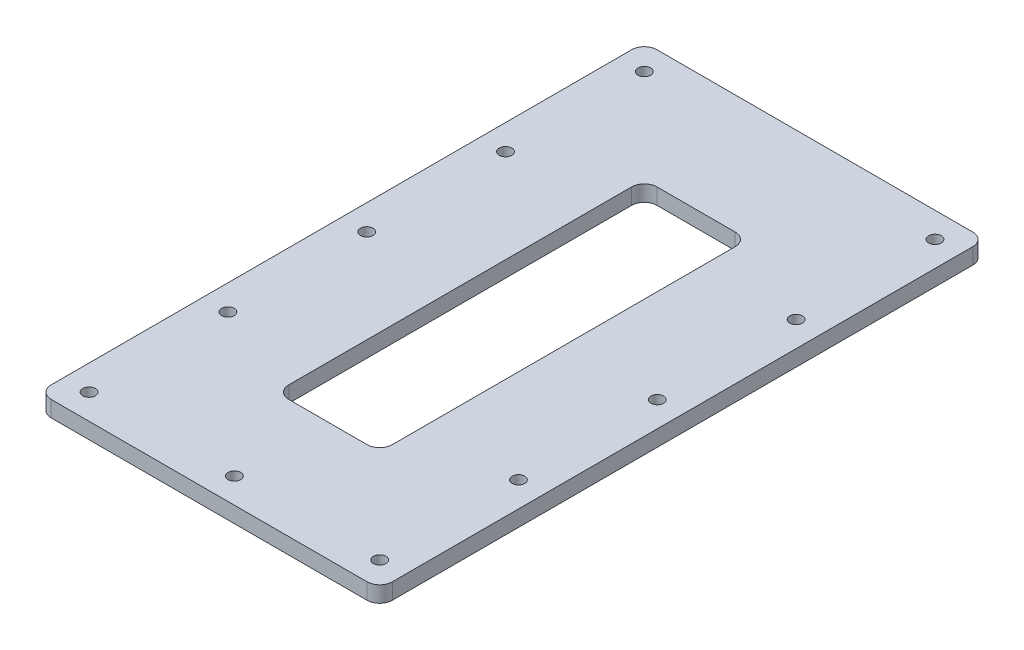
ISO-10303-21;
HEADER;
FILE_DESCRIPTION(('STEP AP214'),'2;1');
FILE_NAME('part.step','',(''),(''),'','','');
FILE_SCHEMA(('AUTOMOTIVE_DESIGN { 1 0 10303 214 1 1 1 1 }'));
ENDSEC;
DATA;
#1=APPLICATION_CONTEXT('core data for automotive mechanical design processes');
#2=APPLICATION_PROTOCOL_DEFINITION('international standard','automotive_design',2000,#1);
#3=PRODUCT_CONTEXT('',#1,'mechanical');
#4=PRODUCT('Part','Part','',(#3));
#5=PRODUCT_RELATED_PRODUCT_CATEGORY('part','',(#4));
#6=PRODUCT_DEFINITION_FORMATION('','',#4);
#7=PRODUCT_DEFINITION_CONTEXT('part definition',#1,'design');
#8=PRODUCT_DEFINITION('design','',#6,#7);
#9=PRODUCT_DEFINITION_SHAPE('','',#8);
#10=(LENGTH_UNIT() NAMED_UNIT(*) SI_UNIT(.MILLI.,.METRE.));
#11=(NAMED_UNIT(*) PLANE_ANGLE_UNIT() SI_UNIT($,.RADIAN.));
#12=(NAMED_UNIT(*) SI_UNIT($,.STERADIAN.) SOLID_ANGLE_UNIT());
#13=UNCERTAINTY_MEASURE_WITH_UNIT(LENGTH_MEASURE(1.E-05),#10,'distance_accuracy_value','');
#14=(GEOMETRIC_REPRESENTATION_CONTEXT(3) GLOBAL_UNCERTAINTY_ASSIGNED_CONTEXT((#13)) GLOBAL_UNIT_ASSIGNED_CONTEXT((#10,
#11,#12)) REPRESENTATION_CONTEXT('',''));
#15=CARTESIAN_POINT('',(0.,0.,0.));
#16=DIRECTION('',(0.,0.,1.));
#17=DIRECTION('',(1.,0.,0.));
#18=AXIS2_PLACEMENT_3D('',#15,#16,#17);
#19=CARTESIAN_POINT('',(-67.575,-6.35,-120.));
#20=DIRECTION('',(1.,0.,0.));
#21=DIRECTION('',(0.,0.,1.));
#22=AXIS2_PLACEMENT_3D('',#19,#20,#21);
#23=PLANE('',#22);
#24=DIRECTION('',(0.,0.,1.));
#25=VECTOR('',#24,1.);
#26=CARTESIAN_POINT('',(-67.575,-6.35,-120.));
#27=LINE('',#26,#25);
#28=CARTESIAN_POINT('',(-67.575,-6.35,-115.));
#29=VERTEX_POINT('',#28);
#30=CARTESIAN_POINT('',(-67.575,-6.35,115.));
#31=VERTEX_POINT('',#30);
#32=EDGE_CURVE('E255',#29,#31,#27,.T.);
#33=ORIENTED_EDGE('',*,*,#32,.T.);
#34=DIRECTION('',(0.,1.,0.));
#35=VECTOR('',#34,1.);
#36=CARTESIAN_POINT('',(-67.575,-6.35,115.));
#37=LINE('',#36,#35);
#38=CARTESIAN_POINT('',(-67.575,0.,115.));
#39=VERTEX_POINT('',#38);
#40=EDGE_CURVE('E313',#39,#31,#37,.F.);
#41=ORIENTED_EDGE('',*,*,#40,.F.);
#42=DIRECTION('',(0.,0.,1.));
#43=VECTOR('',#42,1.);
#44=CARTESIAN_POINT('',(-67.575,0.,-120.));
#45=LINE('',#44,#43);
#46=CARTESIAN_POINT('',(-67.575,0.,-115.));
#47=VERTEX_POINT('',#46);
#48=EDGE_CURVE('E263',#47,#39,#45,.T.);
#49=ORIENTED_EDGE('',*,*,#48,.F.);
#50=DIRECTION('',(0.,1.,0.));
#51=VECTOR('',#50,1.);
#52=CARTESIAN_POINT('',(-67.575,-6.35,-115.));
#53=LINE('',#52,#51);
#54=EDGE_CURVE('E316',#29,#47,#53,.T.);
#55=ORIENTED_EDGE('',*,*,#54,.F.);
#56=EDGE_LOOP('',(#33,#41,#49,#55));
#57=FACE_BOUND('',#56,.T.);
#58=ADVANCED_FACE('F34',(#57),#23,.F.);
#59=CARTESIAN_POINT('',(67.575,-6.35,-120.));
#60=DIRECTION('',(-1.,0.,0.));
#61=DIRECTION('',(0.,0.,-1.));
#62=AXIS2_PLACEMENT_3D('',#59,#60,#61);
#63=PLANE('',#62);
#64=DIRECTION('',(0.,0.,-1.));
#65=VECTOR('',#64,1.);
#66=CARTESIAN_POINT('',(67.575,0.,-120.));
#67=LINE('',#66,#65);
#68=CARTESIAN_POINT('',(67.575,0.,115.));
#69=VERTEX_POINT('',#68);
#70=CARTESIAN_POINT('',(67.575,0.,-115.));
#71=VERTEX_POINT('',#70);
#72=EDGE_CURVE('E248',#69,#71,#67,.T.);
#73=ORIENTED_EDGE('',*,*,#72,.F.);
#74=DIRECTION('',(0.,1.,0.));
#75=VECTOR('',#74,1.);
#76=CARTESIAN_POINT('',(67.575,-6.35,115.));
#77=LINE('',#76,#75);
#78=CARTESIAN_POINT('',(67.575,-6.35,115.));
#79=VERTEX_POINT('',#78);
#80=EDGE_CURVE('E297',#79,#69,#77,.T.);
#81=ORIENTED_EDGE('',*,*,#80,.F.);
#82=DIRECTION('',(0.,0.,-1.));
#83=VECTOR('',#82,1.);
#84=CARTESIAN_POINT('',(67.575,-6.35,-120.));
#85=LINE('',#84,#83);
#86=CARTESIAN_POINT('',(67.575,-6.35,-115.));
#87=VERTEX_POINT('',#86);
#88=EDGE_CURVE('E249',#79,#87,#85,.T.);
#89=ORIENTED_EDGE('',*,*,#88,.T.);
#90=DIRECTION('',(0.,1.,0.));
#91=VECTOR('',#90,1.);
#92=CARTESIAN_POINT('',(67.575,-6.35,-115.));
#93=LINE('',#92,#91);
#94=EDGE_CURVE('E300',#71,#87,#93,.F.);
#95=ORIENTED_EDGE('',*,*,#94,.F.);
#96=EDGE_LOOP('',(#73,#81,#89,#95));
#97=FACE_BOUND('',#96,.T.);
#98=ADVANCED_FACE('F346',(#97),#63,.F.);
#99=CARTESIAN_POINT('',(-62.575,-6.35,-115.));
#100=DIRECTION('',(0.,1.,0.));
#101=DIRECTION('',(0.,0.,1.));
#102=AXIS2_PLACEMENT_3D('',#99,#100,#101);
#103=CYLINDRICAL_SURFACE('',#102,5.);
#104=CARTESIAN_POINT('',(-62.575,-6.35,-115.));
#105=DIRECTION('',(0.,1.,0.));
#106=DIRECTION('',(0.,0.,-1.));
#107=AXIS2_PLACEMENT_3D('',#104,#105,#106);
#108=CIRCLE('',#107,5.);
#109=CARTESIAN_POINT('',(-62.575,-6.35,-120.));
#110=VERTEX_POINT('',#109);
#111=EDGE_CURVE('E308',#110,#29,#108,.T.);
#112=ORIENTED_EDGE('',*,*,#111,.T.);
#113=ORIENTED_EDGE('',*,*,#54,.T.);
#114=CARTESIAN_POINT('',(-62.575,0.,-115.));
#115=DIRECTION('',(0.,1.,0.));
#116=DIRECTION('',(0.,0.,-1.));
#117=AXIS2_PLACEMENT_3D('',#114,#115,#116);
#118=CIRCLE('',#117,5.);
#119=CARTESIAN_POINT('',(-62.575,0.,-120.));
#120=VERTEX_POINT('',#119);
#121=EDGE_CURVE('E292',#47,#120,#118,.F.);
#122=ORIENTED_EDGE('',*,*,#121,.T.);
#123=DIRECTION('',(0.,1.,0.));
#124=VECTOR('',#123,1.);
#125=CARTESIAN_POINT('',(-62.575,-6.35,-120.));
#126=LINE('',#125,#124);
#127=EDGE_CURVE('E282',#120,#110,#126,.F.);
#128=ORIENTED_EDGE('',*,*,#127,.T.);
#129=EDGE_LOOP('',(#112,#113,#122,#128));
#130=FACE_BOUND('',#129,.T.);
#131=ADVANCED_FACE('F335',(#130),#103,.T.);
#132=CARTESIAN_POINT('',(62.575,-6.35,-115.));
#133=DIRECTION('',(0.,1.,0.));
#134=DIRECTION('',(0.,0.,1.));
#135=AXIS2_PLACEMENT_3D('',#132,#133,#134);
#136=CYLINDRICAL_SURFACE('',#135,5.);
#137=CARTESIAN_POINT('',(62.575,-6.35,-115.));
#138=DIRECTION('',(0.,1.,0.));
#139=DIRECTION('',(0.,0.,-1.));
#140=AXIS2_PLACEMENT_3D('',#137,#138,#139);
#141=CIRCLE('',#140,5.);
#142=CARTESIAN_POINT('',(62.575,-6.35,-120.));
#143=VERTEX_POINT('',#142);
#144=EDGE_CURVE('E310',#87,#143,#141,.T.);
#145=ORIENTED_EDGE('',*,*,#144,.T.);
#146=DIRECTION('',(0.,1.,0.));
#147=VECTOR('',#146,1.);
#148=CARTESIAN_POINT('',(62.575,-6.35,-120.));
#149=LINE('',#148,#147);
#150=CARTESIAN_POINT('',(62.575,0.,-120.));
#151=VERTEX_POINT('',#150);
#152=EDGE_CURVE('E285',#143,#151,#149,.T.);
#153=ORIENTED_EDGE('',*,*,#152,.T.);
#154=CARTESIAN_POINT('',(62.575,0.,-115.));
#155=DIRECTION('',(0.,1.,0.));
#156=DIRECTION('',(0.,0.,-1.));
#157=AXIS2_PLACEMENT_3D('',#154,#155,#156);
#158=CIRCLE('',#157,5.);
#159=EDGE_CURVE('E295',#151,#71,#158,.F.);
#160=ORIENTED_EDGE('',*,*,#159,.T.);
#161=ORIENTED_EDGE('',*,*,#94,.T.);
#162=EDGE_LOOP('',(#145,#153,#160,#161));
#163=FACE_BOUND('',#162,.T.);
#164=ADVANCED_FACE('F341',(#163),#136,.T.);
#165=CARTESIAN_POINT('',(-62.575,-6.35,115.));
#166=DIRECTION('',(0.,1.,0.));
#167=DIRECTION('',(0.,0.,1.));
#168=AXIS2_PLACEMENT_3D('',#165,#166,#167);
#169=CYLINDRICAL_SURFACE('',#168,5.);
#170=CARTESIAN_POINT('',(-62.575,-6.35,115.));
#171=DIRECTION('',(0.,1.,0.));
#172=DIRECTION('',(0.,0.,-1.));
#173=AXIS2_PLACEMENT_3D('',#170,#171,#172);
#174=CIRCLE('',#173,5.);
#175=CARTESIAN_POINT('',(-62.575,-6.35,120.));
#176=VERTEX_POINT('',#175);
#177=EDGE_CURVE('E303',#31,#176,#174,.T.);
#178=ORIENTED_EDGE('',*,*,#177,.T.);
#179=DIRECTION('',(0.,1.,0.));
#180=VECTOR('',#179,1.);
#181=CARTESIAN_POINT('',(-62.575,-6.35,120.));
#182=LINE('',#181,#180);
#183=CARTESIAN_POINT('',(-62.575,0.,120.));
#184=VERTEX_POINT('',#183);
#185=EDGE_CURVE('E179',#176,#184,#182,.T.);
#186=ORIENTED_EDGE('',*,*,#185,.T.);
#187=CARTESIAN_POINT('',(-62.575,0.,115.));
#188=DIRECTION('',(0.,1.,0.));
#189=DIRECTION('',(0.,0.,-1.));
#190=AXIS2_PLACEMENT_3D('',#187,#188,#189);
#191=CIRCLE('',#190,5.);
#192=EDGE_CURVE('E288',#184,#39,#191,.F.);
#193=ORIENTED_EDGE('',*,*,#192,.T.);
#194=ORIENTED_EDGE('',*,*,#40,.T.);
#195=EDGE_LOOP('',(#178,#186,#193,#194));
#196=FACE_BOUND('',#195,.T.);
#197=ADVANCED_FACE('F36',(#196),#169,.T.);
#198=CARTESIAN_POINT('',(-20.5132278041638,3.65,-72.9382278041638));
#199=DIRECTION('',(-1.,0.,0.));
#200=DIRECTION('',(0.,1.,0.));
#201=AXIS2_PLACEMENT_3D('',#198,#199,#200);
#202=PLANE('',#201);
#203=DIRECTION('',(0.,0.,1.));
#204=VECTOR('',#203,1.);
#205=CARTESIAN_POINT('',(-20.5132278041638,-6.35,-72.9382278041638));
#206=LINE('',#205,#204);
#207=CARTESIAN_POINT('',(-20.5132278041638,-6.35,-67.9382278041638));
#208=VERTEX_POINT('',#207);
#209=CARTESIAN_POINT('',(-20.5132278041638,-6.35,67.9382278041638));
#210=VERTEX_POINT('',#209);
#211=EDGE_CURVE('E170',#208,#210,#206,.T.);
#212=ORIENTED_EDGE('',*,*,#211,.F.);
#213=DIRECTION('',(0.,-1.,0.));
#214=VECTOR('',#213,1.);
#215=CARTESIAN_POINT('',(-20.5132278041638,-6.35,-67.9382278041638));
#216=LINE('',#215,#214);
#217=CARTESIAN_POINT('',(-20.5132278041638,0.,-67.9382278041638));
#218=VERTEX_POINT('',#217);
#219=EDGE_CURVE('E159',#218,#208,#216,.T.);
#220=ORIENTED_EDGE('',*,*,#219,.F.);
#221=DIRECTION('',(0.,0.,1.));
#222=VECTOR('',#221,1.);
#223=CARTESIAN_POINT('',(-20.5132278041638,0.,0.));
#224=LINE('',#223,#222);
#225=CARTESIAN_POINT('',(-20.5132278041638,0.,67.9382278041638));
#226=VERTEX_POINT('',#225);
#227=EDGE_CURVE('E240',#218,#226,#224,.T.);
#228=ORIENTED_EDGE('',*,*,#227,.T.);
#229=DIRECTION('',(0.,-1.,0.));
#230=VECTOR('',#229,1.);
#231=CARTESIAN_POINT('',(-20.5132278041638,0.,67.9382278041638));
#232=LINE('',#231,#230);
#233=EDGE_CURVE('E270',#210,#226,#232,.F.);
#234=ORIENTED_EDGE('',*,*,#233,.F.);
#235=EDGE_LOOP('',(#212,#220,#228,#234));
#236=FACE_BOUND('',#235,.T.);
#237=ADVANCED_FACE('F398',(#236),#202,.F.);
#238=CARTESIAN_POINT('',(0.,-6.35,0.));
#239=DIRECTION('',(0.,-1.,0.));
#240=DIRECTION('',(0.,0.,-1.));
#241=AXIS2_PLACEMENT_3D('',#238,#239,#240);
#242=PLANE('',#241);
#243=CARTESIAN_POINT('',(-57.5749999999999,-6.35,-110.));
#244=DIRECTION('',(0.,1.,0.));
#245=DIRECTION('',(0.,0.,-1.));
#246=AXIS2_PLACEMENT_3D('',#243,#244,#245);
#247=CIRCLE('',#246,2.5);
#248=CARTESIAN_POINT('',(-57.5749999999999,-6.35,-112.5));
#249=VERTEX_POINT('',#248);
#250=EDGE_CURVE('E38',#249,#249,#247,.T.);
#251=ORIENTED_EDGE('',*,*,#250,.T.);
#252=EDGE_LOOP('',(#251));
#253=FACE_BOUND('',#252,.T.);
#254=CARTESIAN_POINT('',(57.5750000000001,-6.35,-110.));
#255=DIRECTION('',(0.,1.,0.));
#256=DIRECTION('',(0.,0.,-1.));
#257=AXIS2_PLACEMENT_3D('',#254,#255,#256);
#258=CIRCLE('',#257,2.50000000000001);
#259=CARTESIAN_POINT('',(57.5750000000001,-6.35,-112.5));
#260=VERTEX_POINT('',#259);
#261=EDGE_CURVE('E220',#260,#260,#258,.T.);
#262=ORIENTED_EDGE('',*,*,#261,.T.);
#263=EDGE_LOOP('',(#262));
#264=FACE_BOUND('',#263,.T.);
#265=CARTESIAN_POINT('',(57.5750000000001,-6.35,-55.));
#266=DIRECTION('',(0.,1.,0.));
#267=DIRECTION('',(0.,0.,-1.));
#268=AXIS2_PLACEMENT_3D('',#265,#266,#267);
#269=CIRCLE('',#268,2.5);
#270=CARTESIAN_POINT('',(57.5750000000001,-6.35,-57.5));
#271=VERTEX_POINT('',#270);
#272=EDGE_CURVE('E218',#271,#271,#269,.T.);
#273=ORIENTED_EDGE('',*,*,#272,.T.);
#274=EDGE_LOOP('',(#273));
#275=FACE_BOUND('',#274,.T.);
#276=CARTESIAN_POINT('',(-57.5749999999999,-6.35,-55.));
#277=DIRECTION('',(0.,1.,0.));
#278=DIRECTION('',(0.,0.,-1.));
#279=AXIS2_PLACEMENT_3D('',#276,#277,#278);
#280=CIRCLE('',#279,2.5);
#281=CARTESIAN_POINT('',(-57.5749999999999,-6.35,-57.5));
#282=VERTEX_POINT('',#281);
#283=EDGE_CURVE('E215',#282,#282,#280,.T.);
#284=ORIENTED_EDGE('',*,*,#283,.T.);
#285=EDGE_LOOP('',(#284));
#286=FACE_BOUND('',#285,.T.);
#287=CARTESIAN_POINT('',(-57.5749999999999,-6.35,0.));
#288=DIRECTION('',(0.,1.,0.));
#289=DIRECTION('',(0.,0.,-1.));
#290=AXIS2_PLACEMENT_3D('',#287,#288,#289);
#291=CIRCLE('',#290,2.5);
#292=CARTESIAN_POINT('',(-57.5749999999999,-6.35,-2.49999999999996));
#293=VERTEX_POINT('',#292);
#294=EDGE_CURVE('E212',#293,#293,#291,.T.);
#295=ORIENTED_EDGE('',*,*,#294,.T.);
#296=EDGE_LOOP('',(#295));
#297=FACE_BOUND('',#296,.T.);
#298=CARTESIAN_POINT('',(57.5750000000001,-6.35,0.));
#299=DIRECTION('',(0.,1.,0.));
#300=DIRECTION('',(0.,0.,-1.));
#301=AXIS2_PLACEMENT_3D('',#298,#299,#300);
#302=CIRCLE('',#301,2.5);
#303=CARTESIAN_POINT('',(57.5750000000001,-6.35,-2.49999999999996));
#304=VERTEX_POINT('',#303);
#305=EDGE_CURVE('E209',#304,#304,#302,.T.);
#306=ORIENTED_EDGE('',*,*,#305,.T.);
#307=EDGE_LOOP('',(#306));
#308=FACE_BOUND('',#307,.T.);
#309=CARTESIAN_POINT('',(57.5750000000001,-6.35,55.));
#310=DIRECTION('',(0.,1.,0.));
#311=DIRECTION('',(0.,0.,-1.));
#312=AXIS2_PLACEMENT_3D('',#309,#310,#311);
#313=CIRCLE('',#312,2.5);
#314=CARTESIAN_POINT('',(57.5750000000001,-6.35,52.5));
#315=VERTEX_POINT('',#314);
#316=EDGE_CURVE('E206',#315,#315,#313,.T.);
#317=ORIENTED_EDGE('',*,*,#316,.T.);
#318=EDGE_LOOP('',(#317));
#319=FACE_BOUND('',#318,.T.);
#320=CARTESIAN_POINT('',(-57.5749999999999,-6.35,55.));
#321=DIRECTION('',(0.,1.,0.));
#322=DIRECTION('',(0.,0.,-1.));
#323=AXIS2_PLACEMENT_3D('',#320,#321,#322);
#324=CIRCLE('',#323,2.5);
#325=CARTESIAN_POINT('',(-57.5749999999999,-6.35,52.5));
#326=VERTEX_POINT('',#325);
#327=EDGE_CURVE('E203',#326,#326,#324,.T.);
#328=ORIENTED_EDGE('',*,*,#327,.T.);
#329=EDGE_LOOP('',(#328));
#330=FACE_BOUND('',#329,.T.);
#331=CARTESIAN_POINT('',(-57.5749999999999,-6.35,110.));
#332=DIRECTION('',(0.,1.,0.));
#333=DIRECTION('',(0.,0.,-1.));
#334=AXIS2_PLACEMENT_3D('',#331,#332,#333);
#335=CIRCLE('',#334,2.50000000000001);
#336=CARTESIAN_POINT('',(-57.5749999999999,-6.35,107.5));
#337=VERTEX_POINT('',#336);
#338=EDGE_CURVE('E200',#337,#337,#335,.T.);
#339=ORIENTED_EDGE('',*,*,#338,.T.);
#340=EDGE_LOOP('',(#339));
#341=FACE_BOUND('',#340,.T.);
#342=CARTESIAN_POINT('',(1.11022302462516E-13,-6.35,110.));
#343=DIRECTION('',(0.,1.,0.));
#344=DIRECTION('',(0.,0.,-1.));
#345=AXIS2_PLACEMENT_3D('',#342,#343,#344);
#346=CIRCLE('',#345,2.5);
#347=CARTESIAN_POINT('',(1.11022302462516E-13,-6.35,107.5));
#348=VERTEX_POINT('',#347);
#349=EDGE_CURVE('E196',#348,#348,#346,.T.);
#350=ORIENTED_EDGE('',*,*,#349,.T.);
#351=EDGE_LOOP('',(#350));
#352=FACE_BOUND('',#351,.T.);
#353=CARTESIAN_POINT('',(57.5750000000001,-6.35,110.));
#354=DIRECTION('',(0.,1.,0.));
#355=DIRECTION('',(0.,0.,-1.));
#356=AXIS2_PLACEMENT_3D('',#353,#354,#355);
#357=CIRCLE('',#356,2.5);
#358=CARTESIAN_POINT('',(57.5750000000001,-6.35,107.5));
#359=VERTEX_POINT('',#358);
#360=EDGE_CURVE('E193',#359,#359,#357,.T.);
#361=ORIENTED_EDGE('',*,*,#360,.T.);
#362=EDGE_LOOP('',(#361));
#363=FACE_BOUND('',#362,.T.);
#364=DIRECTION('',(0.,0.,-1.));
#365=VECTOR('',#364,1.);
#366=CARTESIAN_POINT('',(20.5132278041638,-6.35,-72.9382278041638));
#367=LINE('',#366,#365);
#368=CARTESIAN_POINT('',(20.5132278041638,-6.35,67.9382278041638));
#369=VERTEX_POINT('',#368);
#370=CARTESIAN_POINT('',(20.5132278041638,-6.35,-67.9382278041638));
#371=VERTEX_POINT('',#370);
#372=EDGE_CURVE('E225',#369,#371,#367,.T.);
#373=ORIENTED_EDGE('',*,*,#372,.T.);
#374=CARTESIAN_POINT('',(15.5132278041638,-6.35,-67.9382278041638));
#375=DIRECTION('',(0.,1.,0.));
#376=DIRECTION('',(0.,0.,-1.));
#377=AXIS2_PLACEMENT_3D('',#374,#375,#376);
#378=CIRCLE('',#377,5.);
#379=CARTESIAN_POINT('',(15.5132278041638,-6.35,-72.9382278041638));
#380=VERTEX_POINT('',#379);
#381=EDGE_CURVE('E186',#380,#371,#378,.F.);
#382=ORIENTED_EDGE('',*,*,#381,.F.);
#383=DIRECTION('',(-1.,0.,0.));
#384=VECTOR('',#383,1.);
#385=CARTESIAN_POINT('',(-20.5132278041638,-6.35,-72.9382278041638));
#386=LINE('',#385,#384);
#387=CARTESIAN_POINT('',(-15.5132278041638,-6.35,-72.9382278041638));
#388=VERTEX_POINT('',#387);
#389=EDGE_CURVE('E228',#380,#388,#386,.T.);
#390=ORIENTED_EDGE('',*,*,#389,.T.);
#391=CARTESIAN_POINT('',(-15.5132278041638,-6.35,-67.9382278041638));
#392=DIRECTION('',(0.,1.,0.));
#393=DIRECTION('',(0.,0.,-1.));
#394=AXIS2_PLACEMENT_3D('',#391,#392,#393);
#395=CIRCLE('',#394,5.);
#396=EDGE_CURVE('E43',#208,#388,#395,.F.);
#397=ORIENTED_EDGE('',*,*,#396,.F.);
#398=ORIENTED_EDGE('',*,*,#211,.T.);
#399=CARTESIAN_POINT('',(-15.5132278041638,-6.35,67.9382278041638));
#400=DIRECTION('',(0.,1.,0.));
#401=DIRECTION('',(0.,0.,-1.));
#402=AXIS2_PLACEMENT_3D('',#399,#400,#401);
#403=CIRCLE('',#402,5.);
#404=CARTESIAN_POINT('',(-15.5132278041638,-6.35,72.9382278041638));
#405=VERTEX_POINT('',#404);
#406=EDGE_CURVE('E153',#405,#210,#403,.F.);
#407=ORIENTED_EDGE('',*,*,#406,.F.);
#408=DIRECTION('',(1.,0.,0.));
#409=VECTOR('',#408,1.);
#410=CARTESIAN_POINT('',(-20.5132278041638,-6.35,72.9382278041638));
#411=LINE('',#410,#409);
#412=CARTESIAN_POINT('',(15.5132278041638,-6.35,72.9382278041638));
#413=VERTEX_POINT('',#412);
#414=EDGE_CURVE('E163',#405,#413,#411,.T.);
#415=ORIENTED_EDGE('',*,*,#414,.T.);
#416=CARTESIAN_POINT('',(15.5132278041638,-6.35,67.9382278041638));
#417=DIRECTION('',(0.,1.,0.));
#418=DIRECTION('',(0.,0.,-1.));
#419=AXIS2_PLACEMENT_3D('',#416,#417,#418);
#420=CIRCLE('',#419,5.);
#421=EDGE_CURVE('E177',#369,#413,#420,.F.);
#422=ORIENTED_EDGE('',*,*,#421,.F.);
#423=EDGE_LOOP('',(#373,#382,#390,#397,#398,#407,#415,#422));
#424=FACE_BOUND('',#423,.T.);
#425=ORIENTED_EDGE('',*,*,#88,.F.);
#426=CARTESIAN_POINT('',(62.575,-6.35,115.));
#427=DIRECTION('',(0.,1.,0.));
#428=DIRECTION('',(0.,0.,-1.));
#429=AXIS2_PLACEMENT_3D('',#426,#427,#428);
#430=CIRCLE('',#429,5.);
#431=CARTESIAN_POINT('',(62.575,-6.35,120.));
#432=VERTEX_POINT('',#431);
#433=EDGE_CURVE('E306',#432,#79,#430,.T.);
#434=ORIENTED_EDGE('',*,*,#433,.F.);
#435=DIRECTION('',(1.,0.,0.));
#436=VECTOR('',#435,1.);
#437=CARTESIAN_POINT('',(-67.575,-6.35,120.));
#438=LINE('',#437,#436);
#439=EDGE_CURVE('E58',#176,#432,#438,.T.);
#440=ORIENTED_EDGE('',*,*,#439,.F.);
#441=ORIENTED_EDGE('',*,*,#177,.F.);
#442=ORIENTED_EDGE('',*,*,#32,.F.);
#443=ORIENTED_EDGE('',*,*,#111,.F.);
#444=DIRECTION('',(-1.,0.,0.));
#445=VECTOR('',#444,1.);
#446=CARTESIAN_POINT('',(-67.575,-6.35,-120.));
#447=LINE('',#446,#445);
#448=EDGE_CURVE('E252',#143,#110,#447,.T.);
#449=ORIENTED_EDGE('',*,*,#448,.F.);
#450=ORIENTED_EDGE('',*,*,#144,.F.);
#451=EDGE_LOOP('',(#425,#434,#440,#441,#442,#443,#449,#450));
#452=FACE_BOUND('',#451,.T.);
#453=ADVANCED_FACE('F174',(#253,#264,#275,#286,#297,#308,#319,#330,#341,#352,#363,#424,#452),
#242,.T.);
#454=CARTESIAN_POINT('',(-57.5749999999999,-10.,-110.));
#455=DIRECTION('',(0.,1.,0.));
#456=DIRECTION('',(0.,0.,1.));
#457=AXIS2_PLACEMENT_3D('',#454,#455,#456);
#458=CYLINDRICAL_SURFACE('',#457,2.5);
#459=ORIENTED_EDGE('',*,*,#250,.F.);
#460=EDGE_LOOP('',(#459));
#461=FACE_BOUND('',#460,.T.);
#462=CARTESIAN_POINT('',(-57.5749999999999,0.,-110.));
#463=DIRECTION('',(0.,-1.,0.));
#464=DIRECTION('',(0.,0.,1.));
#465=AXIS2_PLACEMENT_3D('',#462,#463,#464);
#466=CIRCLE('',#465,2.5);
#467=CARTESIAN_POINT('',(-57.5749999999999,0.,-107.5));
#468=VERTEX_POINT('',#467);
#469=EDGE_CURVE('E656',#468,#468,#466,.T.);
#470=ORIENTED_EDGE('',*,*,#469,.F.);
#471=EDGE_LOOP('',(#470));
#472=FACE_BOUND('',#471,.T.);
#473=ADVANCED_FACE('F413',(#461,#472),#458,.F.);
#474=CARTESIAN_POINT('',(57.5750000000001,-10.,-110.));
#475=DIRECTION('',(0.,1.,0.));
#476=DIRECTION('',(0.,0.,1.));
#477=AXIS2_PLACEMENT_3D('',#474,#475,#476);
#478=CYLINDRICAL_SURFACE('',#477,2.50000000000001);
#479=ORIENTED_EDGE('',*,*,#261,.F.);
#480=EDGE_LOOP('',(#479));
#481=FACE_BOUND('',#480,.T.);
#482=CARTESIAN_POINT('',(57.5750000000001,0.,-110.));
#483=DIRECTION('',(0.,-1.,0.));
#484=DIRECTION('',(0.,0.,1.));
#485=AXIS2_PLACEMENT_3D('',#482,#483,#484);
#486=CIRCLE('',#485,2.50000000000001);
#487=CARTESIAN_POINT('',(57.5750000000001,0.,-107.5));
#488=VERTEX_POINT('',#487);
#489=EDGE_CURVE('E654',#488,#488,#486,.T.);
#490=ORIENTED_EDGE('',*,*,#489,.F.);
#491=EDGE_LOOP('',(#490));
#492=FACE_BOUND('',#491,.T.);
#493=ADVANCED_FACE('F421',(#481,#492),#478,.F.);
#494=CARTESIAN_POINT('',(57.5750000000001,-10.,-55.));
#495=DIRECTION('',(0.,1.,0.));
#496=DIRECTION('',(0.,0.,1.));
#497=AXIS2_PLACEMENT_3D('',#494,#495,#496);
#498=CYLINDRICAL_SURFACE('',#497,2.5);
#499=ORIENTED_EDGE('',*,*,#272,.F.);
#500=EDGE_LOOP('',(#499));
#501=FACE_BOUND('',#500,.T.);
#502=CARTESIAN_POINT('',(57.5750000000001,0.,-55.));
#503=DIRECTION('',(0.,-1.,0.));
#504=DIRECTION('',(0.,0.,1.));
#505=AXIS2_PLACEMENT_3D('',#502,#503,#504);
#506=CIRCLE('',#505,2.5);
#507=CARTESIAN_POINT('',(57.5750000000001,0.,-52.5));
#508=VERTEX_POINT('',#507);
#509=EDGE_CURVE('E651',#508,#508,#506,.T.);
#510=ORIENTED_EDGE('',*,*,#509,.F.);
#511=EDGE_LOOP('',(#510));
#512=FACE_BOUND('',#511,.T.);
#513=ADVANCED_FACE('F430',(#501,#512),#498,.F.);
#514=CARTESIAN_POINT('',(-57.5749999999999,-10.,-55.));
#515=DIRECTION('',(0.,1.,0.));
#516=DIRECTION('',(0.,0.,1.));
#517=AXIS2_PLACEMENT_3D('',#514,#515,#516);
#518=CYLINDRICAL_SURFACE('',#517,2.5);
#519=ORIENTED_EDGE('',*,*,#283,.F.);
#520=EDGE_LOOP('',(#519));
#521=FACE_BOUND('',#520,.T.);
#522=CARTESIAN_POINT('',(-57.5749999999999,0.,-55.));
#523=DIRECTION('',(0.,-1.,0.));
#524=DIRECTION('',(0.,0.,1.));
#525=AXIS2_PLACEMENT_3D('',#522,#523,#524);
#526=CIRCLE('',#525,2.5);
#527=CARTESIAN_POINT('',(-57.5749999999999,0.,-52.5));
#528=VERTEX_POINT('',#527);
#529=EDGE_CURVE('E648',#528,#528,#526,.T.);
#530=ORIENTED_EDGE('',*,*,#529,.F.);
#531=EDGE_LOOP('',(#530));
#532=FACE_BOUND('',#531,.T.);
#533=ADVANCED_FACE('F439',(#521,#532),#518,.F.);
#534=CARTESIAN_POINT('',(-57.5749999999999,-10.,0.));
#535=DIRECTION('',(0.,1.,0.));
#536=DIRECTION('',(0.,0.,1.));
#537=AXIS2_PLACEMENT_3D('',#534,#535,#536);
#538=CYLINDRICAL_SURFACE('',#537,2.5);
#539=ORIENTED_EDGE('',*,*,#294,.F.);
#540=EDGE_LOOP('',(#539));
#541=FACE_BOUND('',#540,.T.);
#542=CARTESIAN_POINT('',(-57.5749999999999,0.,0.));
#543=DIRECTION('',(0.,-1.,0.));
#544=DIRECTION('',(0.,0.,1.));
#545=AXIS2_PLACEMENT_3D('',#542,#543,#544);
#546=CIRCLE('',#545,2.5);
#547=CARTESIAN_POINT('',(-57.5749999999999,0.,2.50000000000004));
#548=VERTEX_POINT('',#547);
#549=EDGE_CURVE('E645',#548,#548,#546,.T.);
#550=ORIENTED_EDGE('',*,*,#549,.F.);
#551=EDGE_LOOP('',(#550));
#552=FACE_BOUND('',#551,.T.);
#553=ADVANCED_FACE('F448',(#541,#552),#538,.F.);
#554=CARTESIAN_POINT('',(57.5750000000001,-10.,0.));
#555=DIRECTION('',(0.,1.,0.));
#556=DIRECTION('',(0.,0.,1.));
#557=AXIS2_PLACEMENT_3D('',#554,#555,#556);
#558=CYLINDRICAL_SURFACE('',#557,2.5);
#559=ORIENTED_EDGE('',*,*,#305,.F.);
#560=EDGE_LOOP('',(#559));
#561=FACE_BOUND('',#560,.T.);
#562=CARTESIAN_POINT('',(57.5750000000001,0.,0.));
#563=DIRECTION('',(0.,-1.,0.));
#564=DIRECTION('',(0.,0.,1.));
#565=AXIS2_PLACEMENT_3D('',#562,#563,#564);
#566=CIRCLE('',#565,2.5);
#567=CARTESIAN_POINT('',(57.5750000000001,0.,2.50000000000005));
#568=VERTEX_POINT('',#567);
#569=EDGE_CURVE('E642',#568,#568,#566,.T.);
#570=ORIENTED_EDGE('',*,*,#569,.F.);
#571=EDGE_LOOP('',(#570));
#572=FACE_BOUND('',#571,.T.);
#573=ADVANCED_FACE('F457',(#561,#572),#558,.F.);
#574=CARTESIAN_POINT('',(57.5750000000001,-10.,55.));
#575=DIRECTION('',(0.,1.,0.));
#576=DIRECTION('',(0.,0.,1.));
#577=AXIS2_PLACEMENT_3D('',#574,#575,#576);
#578=CYLINDRICAL_SURFACE('',#577,2.5);
#579=ORIENTED_EDGE('',*,*,#316,.F.);
#580=EDGE_LOOP('',(#579));
#581=FACE_BOUND('',#580,.T.);
#582=CARTESIAN_POINT('',(57.5750000000001,0.,55.));
#583=DIRECTION('',(0.,-1.,0.));
#584=DIRECTION('',(0.,0.,1.));
#585=AXIS2_PLACEMENT_3D('',#582,#583,#584);
#586=CIRCLE('',#585,2.5);
#587=CARTESIAN_POINT('',(57.5750000000001,0.,57.5));
#588=VERTEX_POINT('',#587);
#589=EDGE_CURVE('E639',#588,#588,#586,.T.);
#590=ORIENTED_EDGE('',*,*,#589,.F.);
#591=EDGE_LOOP('',(#590));
#592=FACE_BOUND('',#591,.T.);
#593=ADVANCED_FACE('F466',(#581,#592),#578,.F.);
#594=CARTESIAN_POINT('',(-57.5749999999999,-10.,55.));
#595=DIRECTION('',(0.,1.,0.));
#596=DIRECTION('',(0.,0.,1.));
#597=AXIS2_PLACEMENT_3D('',#594,#595,#596);
#598=CYLINDRICAL_SURFACE('',#597,2.5);
#599=ORIENTED_EDGE('',*,*,#327,.F.);
#600=EDGE_LOOP('',(#599));
#601=FACE_BOUND('',#600,.T.);
#602=CARTESIAN_POINT('',(-57.5749999999999,0.,55.));
#603=DIRECTION('',(0.,-1.,0.));
#604=DIRECTION('',(0.,0.,1.));
#605=AXIS2_PLACEMENT_3D('',#602,#603,#604);
#606=CIRCLE('',#605,2.5);
#607=CARTESIAN_POINT('',(-57.5749999999999,0.,57.5));
#608=VERTEX_POINT('',#607);
#609=EDGE_CURVE('E634',#608,#608,#606,.T.);
#610=ORIENTED_EDGE('',*,*,#609,.F.);
#611=EDGE_LOOP('',(#610));
#612=FACE_BOUND('',#611,.T.);
#613=ADVANCED_FACE('F475',(#601,#612),#598,.F.);
#614=CARTESIAN_POINT('',(-57.5749999999999,-10.,110.));
#615=DIRECTION('',(0.,1.,0.));
#616=DIRECTION('',(0.,0.,1.));
#617=AXIS2_PLACEMENT_3D('',#614,#615,#616);
#618=CYLINDRICAL_SURFACE('',#617,2.50000000000001);
#619=ORIENTED_EDGE('',*,*,#338,.F.);
#620=EDGE_LOOP('',(#619));
#621=FACE_BOUND('',#620,.T.);
#622=CARTESIAN_POINT('',(-57.5749999999999,0.,110.));
#623=DIRECTION('',(0.,-1.,0.));
#624=DIRECTION('',(0.,0.,1.));
#625=AXIS2_PLACEMENT_3D('',#622,#623,#624);
#626=CIRCLE('',#625,2.50000000000001);
#627=CARTESIAN_POINT('',(-57.5749999999999,0.,112.5));
#628=VERTEX_POINT('',#627);
#629=EDGE_CURVE('E629',#628,#628,#626,.T.);
#630=ORIENTED_EDGE('',*,*,#629,.F.);
#631=EDGE_LOOP('',(#630));
#632=FACE_BOUND('',#631,.T.);
#633=ADVANCED_FACE('F484',(#621,#632),#618,.F.);
#634=CARTESIAN_POINT('',(1.11022302462516E-13,-10.,110.));
#635=DIRECTION('',(0.,1.,0.));
#636=DIRECTION('',(0.,0.,1.));
#637=AXIS2_PLACEMENT_3D('',#634,#635,#636);
#638=CYLINDRICAL_SURFACE('',#637,2.5);
#639=ORIENTED_EDGE('',*,*,#349,.F.);
#640=EDGE_LOOP('',(#639));
#641=FACE_BOUND('',#640,.T.);
#642=CARTESIAN_POINT('',(1.11022302462516E-13,0.,110.));
#643=DIRECTION('',(0.,-1.,0.));
#644=DIRECTION('',(0.,0.,1.));
#645=AXIS2_PLACEMENT_3D('',#642,#643,#644);
#646=CIRCLE('',#645,2.5);
#647=CARTESIAN_POINT('',(1.11022302462516E-13,0.,112.5));
#648=VERTEX_POINT('',#647);
#649=EDGE_CURVE('E627',#648,#648,#646,.T.);
#650=ORIENTED_EDGE('',*,*,#649,.F.);
#651=EDGE_LOOP('',(#650));
#652=FACE_BOUND('',#651,.T.);
#653=ADVANCED_FACE('F493',(#641,#652),#638,.F.);
#654=CARTESIAN_POINT('',(57.5750000000001,-10.,110.));
#655=DIRECTION('',(0.,1.,0.));
#656=DIRECTION('',(0.,0.,1.));
#657=AXIS2_PLACEMENT_3D('',#654,#655,#656);
#658=CYLINDRICAL_SURFACE('',#657,2.5);
#659=ORIENTED_EDGE('',*,*,#360,.F.);
#660=EDGE_LOOP('',(#659));
#661=FACE_BOUND('',#660,.T.);
#662=CARTESIAN_POINT('',(57.5750000000001,0.,110.));
#663=DIRECTION('',(0.,-1.,0.));
#664=DIRECTION('',(0.,0.,1.));
#665=AXIS2_PLACEMENT_3D('',#662,#663,#664);
#666=CIRCLE('',#665,2.5);
#667=CARTESIAN_POINT('',(57.5750000000001,0.,112.5));
#668=VERTEX_POINT('',#667);
#669=EDGE_CURVE('E197',#668,#668,#666,.T.);
#670=ORIENTED_EDGE('',*,*,#669,.F.);
#671=EDGE_LOOP('',(#670));
#672=FACE_BOUND('',#671,.T.);
#673=ADVANCED_FACE('F502',(#661,#672),#658,.F.);
#674=CARTESIAN_POINT('',(-20.5132278041638,3.65,-72.9382278041638));
#675=DIRECTION('',(0.,0.,-1.));
#676=DIRECTION('',(0.,1.,0.));
#677=AXIS2_PLACEMENT_3D('',#674,#675,#676);
#678=PLANE('',#677);
#679=DIRECTION('',(-1.,0.,0.));
#680=VECTOR('',#679,1.);
#681=CARTESIAN_POINT('',(0.,0.,-72.9382278041638));
#682=LINE('',#681,#680);
#683=CARTESIAN_POINT('',(15.5132278041638,0.,-72.9382278041638));
#684=VERTEX_POINT('',#683);
#685=CARTESIAN_POINT('',(-15.5132278041638,0.,-72.9382278041638));
#686=VERTEX_POINT('',#685);
#687=EDGE_CURVE('E169',#684,#686,#682,.T.);
#688=ORIENTED_EDGE('',*,*,#687,.T.);
#689=DIRECTION('',(0.,-1.,0.));
#690=VECTOR('',#689,1.);
#691=CARTESIAN_POINT('',(-15.5132278041638,0.,-72.9382278041638));
#692=LINE('',#691,#690);
#693=EDGE_CURVE('E277',#388,#686,#692,.F.);
#694=ORIENTED_EDGE('',*,*,#693,.F.);
#695=ORIENTED_EDGE('',*,*,#389,.F.);
#696=DIRECTION('',(0.,-1.,0.));
#697=VECTOR('',#696,1.);
#698=CARTESIAN_POINT('',(15.5132278041638,-6.35,-72.9382278041638));
#699=LINE('',#698,#697);
#700=EDGE_CURVE('E280',#684,#380,#699,.T.);
#701=ORIENTED_EDGE('',*,*,#700,.F.);
#702=EDGE_LOOP('',(#688,#694,#695,#701));
#703=FACE_BOUND('',#702,.T.);
#704=ADVANCED_FACE('F378',(#703),#678,.F.);
#705=CARTESIAN_POINT('',(-15.5132278041638,3.65,-67.9382278041638));
#706=DIRECTION('',(0.,1.,0.));
#707=DIRECTION('',(0.,0.,1.));
#708=AXIS2_PLACEMENT_3D('',#705,#706,#707);
#709=CYLINDRICAL_SURFACE('',#708,5.);
#710=CARTESIAN_POINT('',(-15.5132278041638,0.,-67.9382278041638));
#711=DIRECTION('',(0.,1.,0.));
#712=DIRECTION('',(0.,0.,-1.));
#713=AXIS2_PLACEMENT_3D('',#710,#711,#712);
#714=CIRCLE('',#713,5.);
#715=EDGE_CURVE('E11',#686,#218,#714,.T.);
#716=ORIENTED_EDGE('',*,*,#715,.T.);
#717=ORIENTED_EDGE('',*,*,#219,.T.);
#718=ORIENTED_EDGE('',*,*,#396,.T.);
#719=ORIENTED_EDGE('',*,*,#693,.T.);
#720=EDGE_LOOP('',(#716,#717,#718,#719));
#721=FACE_BOUND('',#720,.T.);
#722=ADVANCED_FACE('F375',(#721),#709,.F.);
#723=CARTESIAN_POINT('',(20.5132278041638,3.65,-72.9382278041638));
#724=DIRECTION('',(1.,0.,0.));
#725=DIRECTION('',(0.,-1.,0.));
#726=AXIS2_PLACEMENT_3D('',#723,#724,#725);
#727=PLANE('',#726);
#728=DIRECTION('',(0.,0.,-1.));
#729=VECTOR('',#728,1.);
#730=CARTESIAN_POINT('',(20.5132278041638,0.,0.));
#731=LINE('',#730,#729);
#732=CARTESIAN_POINT('',(20.5132278041638,0.,67.9382278041638));
#733=VERTEX_POINT('',#732);
#734=CARTESIAN_POINT('',(20.5132278041638,0.,-67.9382278041638));
#735=VERTEX_POINT('',#734);
#736=EDGE_CURVE('E245',#733,#735,#731,.T.);
#737=ORIENTED_EDGE('',*,*,#736,.T.);
#738=DIRECTION('',(0.,-1.,0.));
#739=VECTOR('',#738,1.);
#740=CARTESIAN_POINT('',(20.5132278041638,0.,-67.9382278041638));
#741=LINE('',#740,#739);
#742=EDGE_CURVE('E272',#371,#735,#741,.F.);
#743=ORIENTED_EDGE('',*,*,#742,.F.);
#744=ORIENTED_EDGE('',*,*,#372,.F.);
#745=DIRECTION('',(0.,-1.,0.));
#746=VECTOR('',#745,1.);
#747=CARTESIAN_POINT('',(20.5132278041638,-6.35,67.9382278041638));
#748=LINE('',#747,#746);
#749=EDGE_CURVE('E275',#733,#369,#748,.T.);
#750=ORIENTED_EDGE('',*,*,#749,.F.);
#751=EDGE_LOOP('',(#737,#743,#744,#750));
#752=FACE_BOUND('',#751,.T.);
#753=ADVANCED_FACE('F373',(#752),#727,.F.);
#754=CARTESIAN_POINT('',(15.5132278041638,3.65,-67.9382278041638));
#755=DIRECTION('',(0.,1.,0.));
#756=DIRECTION('',(0.,0.,1.));
#757=AXIS2_PLACEMENT_3D('',#754,#755,#756);
#758=CYLINDRICAL_SURFACE('',#757,5.);
#759=CARTESIAN_POINT('',(15.5132278041638,0.,-67.9382278041638));
#760=DIRECTION('',(0.,1.,0.));
#761=DIRECTION('',(0.,0.,-1.));
#762=AXIS2_PLACEMENT_3D('',#759,#760,#761);
#763=CIRCLE('',#762,5.);
#764=EDGE_CURVE('E189',#735,#684,#763,.T.);
#765=ORIENTED_EDGE('',*,*,#764,.T.);
#766=ORIENTED_EDGE('',*,*,#700,.T.);
#767=ORIENTED_EDGE('',*,*,#381,.T.);
#768=ORIENTED_EDGE('',*,*,#742,.T.);
#769=EDGE_LOOP('',(#765,#766,#767,#768));
#770=FACE_BOUND('',#769,.T.);
#771=ADVANCED_FACE('F370',(#770),#758,.F.);
#772=CARTESIAN_POINT('',(-20.5132278041638,3.65,72.9382278041638));
#773=DIRECTION('',(0.,0.,1.));
#774=DIRECTION('',(0.,-1.,0.));
#775=AXIS2_PLACEMENT_3D('',#772,#773,#774);
#776=PLANE('',#775);
#777=DIRECTION('',(1.,0.,0.));
#778=VECTOR('',#777,1.);
#779=CARTESIAN_POINT('',(0.,0.,72.9382278041638));
#780=LINE('',#779,#778);
#781=CARTESIAN_POINT('',(-15.5132278041638,0.,72.9382278041638));
#782=VERTEX_POINT('',#781);
#783=CARTESIAN_POINT('',(15.5132278041638,0.,72.9382278041638));
#784=VERTEX_POINT('',#783);
#785=EDGE_CURVE('E243',#782,#784,#780,.T.);
#786=ORIENTED_EDGE('',*,*,#785,.T.);
#787=DIRECTION('',(0.,-1.,0.));
#788=VECTOR('',#787,1.);
#789=CARTESIAN_POINT('',(15.5132278041638,0.,72.9382278041638));
#790=LINE('',#789,#788);
#791=EDGE_CURVE('E160',#413,#784,#790,.F.);
#792=ORIENTED_EDGE('',*,*,#791,.F.);
#793=ORIENTED_EDGE('',*,*,#414,.F.);
#794=DIRECTION('',(0.,-1.,0.));
#795=VECTOR('',#794,1.);
#796=CARTESIAN_POINT('',(-15.5132278041638,-6.35,72.9382278041638));
#797=LINE('',#796,#795);
#798=EDGE_CURVE('E148',#782,#405,#797,.T.);
#799=ORIENTED_EDGE('',*,*,#798,.F.);
#800=EDGE_LOOP('',(#786,#792,#793,#799));
#801=FACE_BOUND('',#800,.T.);
#802=ADVANCED_FACE('F164',(#801),#776,.F.);
#803=CARTESIAN_POINT('',(15.5132278041638,3.65,67.9382278041638));
#804=DIRECTION('',(0.,1.,0.));
#805=DIRECTION('',(0.,0.,1.));
#806=AXIS2_PLACEMENT_3D('',#803,#804,#805);
#807=CYLINDRICAL_SURFACE('',#806,5.);
#808=CARTESIAN_POINT('',(15.5132278041638,0.,67.9382278041638));
#809=DIRECTION('',(0.,1.,0.));
#810=DIRECTION('',(0.,0.,-1.));
#811=AXIS2_PLACEMENT_3D('',#808,#809,#810);
#812=CIRCLE('',#811,5.);
#813=EDGE_CURVE('E184',#784,#733,#812,.T.);
#814=ORIENTED_EDGE('',*,*,#813,.T.);
#815=ORIENTED_EDGE('',*,*,#749,.T.);
#816=ORIENTED_EDGE('',*,*,#421,.T.);
#817=ORIENTED_EDGE('',*,*,#791,.T.);
#818=EDGE_LOOP('',(#814,#815,#816,#817));
#819=FACE_BOUND('',#818,.T.);
#820=ADVANCED_FACE('F354',(#819),#807,.F.);
#821=CARTESIAN_POINT('',(-15.5132278041638,3.65,67.9382278041638));
#822=DIRECTION('',(0.,1.,0.));
#823=DIRECTION('',(0.,0.,1.));
#824=AXIS2_PLACEMENT_3D('',#821,#822,#823);
#825=CYLINDRICAL_SURFACE('',#824,5.);
#826=CARTESIAN_POINT('',(-15.5132278041638,0.,67.9382278041638));
#827=DIRECTION('',(0.,1.,0.));
#828=DIRECTION('',(0.,0.,-1.));
#829=AXIS2_PLACEMENT_3D('',#826,#827,#828);
#830=CIRCLE('',#829,5.);
#831=EDGE_CURVE('E155',#226,#782,#830,.T.);
#832=ORIENTED_EDGE('',*,*,#831,.T.);
#833=ORIENTED_EDGE('',*,*,#798,.T.);
#834=ORIENTED_EDGE('',*,*,#406,.T.);
#835=ORIENTED_EDGE('',*,*,#233,.T.);
#836=EDGE_LOOP('',(#832,#833,#834,#835));
#837=FACE_BOUND('',#836,.T.);
#838=ADVANCED_FACE('F150',(#837),#825,.F.);
#839=CARTESIAN_POINT('',(62.575,-6.35,115.));
#840=DIRECTION('',(0.,1.,0.));
#841=DIRECTION('',(0.,0.,1.));
#842=AXIS2_PLACEMENT_3D('',#839,#840,#841);
#843=CYLINDRICAL_SURFACE('',#842,5.);
#844=ORIENTED_EDGE('',*,*,#433,.T.);
#845=ORIENTED_EDGE('',*,*,#80,.T.);
#846=CARTESIAN_POINT('',(62.575,0.,115.));
#847=DIRECTION('',(0.,1.,0.));
#848=DIRECTION('',(0.,0.,-1.));
#849=AXIS2_PLACEMENT_3D('',#846,#847,#848);
#850=CIRCLE('',#849,5.);
#851=CARTESIAN_POINT('',(62.575,0.,120.));
#852=VERTEX_POINT('',#851);
#853=EDGE_CURVE('E290',#69,#852,#850,.F.);
#854=ORIENTED_EDGE('',*,*,#853,.T.);
#855=DIRECTION('',(0.,1.,0.));
#856=VECTOR('',#855,1.);
#857=CARTESIAN_POINT('',(62.575,-6.35,120.));
#858=LINE('',#857,#856);
#859=EDGE_CURVE('E51',#852,#432,#858,.F.);
#860=ORIENTED_EDGE('',*,*,#859,.T.);
#861=EDGE_LOOP('',(#844,#845,#854,#860));
#862=FACE_BOUND('',#861,.T.);
#863=ADVANCED_FACE('F347',(#862),#843,.T.);
#864=CARTESIAN_POINT('',(-67.575,-6.35,120.));
#865=DIRECTION('',(0.,0.,-1.));
#866=DIRECTION('',(1.,0.,0.));
#867=AXIS2_PLACEMENT_3D('',#864,#865,#866);
#868=PLANE('',#867);
#869=DIRECTION('',(1.,0.,0.));
#870=VECTOR('',#869,1.);
#871=CARTESIAN_POINT('',(-67.575,0.,120.));
#872=LINE('',#871,#870);
#873=EDGE_CURVE('E253',#184,#852,#872,.T.);
#874=ORIENTED_EDGE('',*,*,#873,.F.);
#875=ORIENTED_EDGE('',*,*,#185,.F.);
#876=ORIENTED_EDGE('',*,*,#439,.T.);
#877=ORIENTED_EDGE('',*,*,#859,.F.);
#878=EDGE_LOOP('',(#874,#875,#876,#877));
#879=FACE_BOUND('',#878,.T.);
#880=ADVANCED_FACE('F322',(#879),#868,.F.);
#881=CARTESIAN_POINT('',(-67.575,-6.35,-120.));
#882=DIRECTION('',(0.,0.,1.));
#883=DIRECTION('',(-1.,0.,0.));
#884=AXIS2_PLACEMENT_3D('',#881,#882,#883);
#885=PLANE('',#884);
#886=ORIENTED_EDGE('',*,*,#448,.T.);
#887=ORIENTED_EDGE('',*,*,#127,.F.);
#888=DIRECTION('',(-1.,0.,0.));
#889=VECTOR('',#888,1.);
#890=CARTESIAN_POINT('',(-67.575,0.,-120.));
#891=LINE('',#890,#889);
#892=EDGE_CURVE('E261',#151,#120,#891,.T.);
#893=ORIENTED_EDGE('',*,*,#892,.F.);
#894=ORIENTED_EDGE('',*,*,#152,.F.);
#895=EDGE_LOOP('',(#886,#887,#893,#894));
#896=FACE_BOUND('',#895,.T.);
#897=ADVANCED_FACE('F338',(#896),#885,.F.);
#898=CARTESIAN_POINT('',(0.,0.,0.));
#899=DIRECTION('',(0.,-1.,0.));
#900=DIRECTION('',(0.,0.,-1.));
#901=AXIS2_PLACEMENT_3D('',#898,#899,#900);
#902=PLANE('',#901);
#903=ORIENTED_EDGE('',*,*,#121,.F.);
#904=ORIENTED_EDGE('',*,*,#48,.T.);
#905=ORIENTED_EDGE('',*,*,#192,.F.);
#906=ORIENTED_EDGE('',*,*,#873,.T.);
#907=ORIENTED_EDGE('',*,*,#853,.F.);
#908=ORIENTED_EDGE('',*,*,#72,.T.);
#909=ORIENTED_EDGE('',*,*,#159,.F.);
#910=ORIENTED_EDGE('',*,*,#892,.T.);
#911=EDGE_LOOP('',(#903,#904,#905,#906,#907,#908,#909,#910));
#912=FACE_BOUND('',#911,.T.);
#913=ORIENTED_EDGE('',*,*,#669,.T.);
#914=EDGE_LOOP('',(#913));
#915=FACE_BOUND('',#914,.T.);
#916=ORIENTED_EDGE('',*,*,#649,.T.);
#917=EDGE_LOOP('',(#916));
#918=FACE_BOUND('',#917,.T.);
#919=ORIENTED_EDGE('',*,*,#629,.T.);
#920=EDGE_LOOP('',(#919));
#921=FACE_BOUND('',#920,.T.);
#922=ORIENTED_EDGE('',*,*,#609,.T.);
#923=EDGE_LOOP('',(#922));
#924=FACE_BOUND('',#923,.T.);
#925=ORIENTED_EDGE('',*,*,#589,.T.);
#926=EDGE_LOOP('',(#925));
#927=FACE_BOUND('',#926,.T.);
#928=ORIENTED_EDGE('',*,*,#569,.T.);
#929=EDGE_LOOP('',(#928));
#930=FACE_BOUND('',#929,.T.);
#931=ORIENTED_EDGE('',*,*,#549,.T.);
#932=EDGE_LOOP('',(#931));
#933=FACE_BOUND('',#932,.T.);
#934=ORIENTED_EDGE('',*,*,#529,.T.);
#935=EDGE_LOOP('',(#934));
#936=FACE_BOUND('',#935,.T.);
#937=ORIENTED_EDGE('',*,*,#509,.T.);
#938=EDGE_LOOP('',(#937));
#939=FACE_BOUND('',#938,.T.);
#940=ORIENTED_EDGE('',*,*,#489,.T.);
#941=EDGE_LOOP('',(#940));
#942=FACE_BOUND('',#941,.T.);
#943=ORIENTED_EDGE('',*,*,#469,.T.);
#944=EDGE_LOOP('',(#943));
#945=FACE_BOUND('',#944,.T.);
#946=ORIENTED_EDGE('',*,*,#227,.F.);
#947=ORIENTED_EDGE('',*,*,#715,.F.);
#948=ORIENTED_EDGE('',*,*,#687,.F.);
#949=ORIENTED_EDGE('',*,*,#764,.F.);
#950=ORIENTED_EDGE('',*,*,#736,.F.);
#951=ORIENTED_EDGE('',*,*,#813,.F.);
#952=ORIENTED_EDGE('',*,*,#785,.F.);
#953=ORIENTED_EDGE('',*,*,#831,.F.);
#954=EDGE_LOOP('',(#946,#947,#948,#949,#950,#951,#952,#953));
#955=FACE_BOUND('',#954,.T.);
#956=ADVANCED_FACE('F324',(#912,#915,#918,#921,#924,#927,#930,#933,#936,#939,#942,#945,#955),
#902,.F.);
#957=CLOSED_SHELL('',(#58,#98,#131,#164,#197,#237,#453,#473,#493,#513,#533,#553,#573,#593,#613,
#633,#653,#673,#704,#722,#753,#771,#802,#820,#838,#863,#880,#897,#956));
#958=MANIFOLD_SOLID_BREP('B2',#957);
#959=ADVANCED_BREP_SHAPE_REPRESENTATION('',(#18,#958),#14);
#960=SHAPE_DEFINITION_REPRESENTATION(#9,#959);
ENDSEC;
END-ISO-10303-21;
